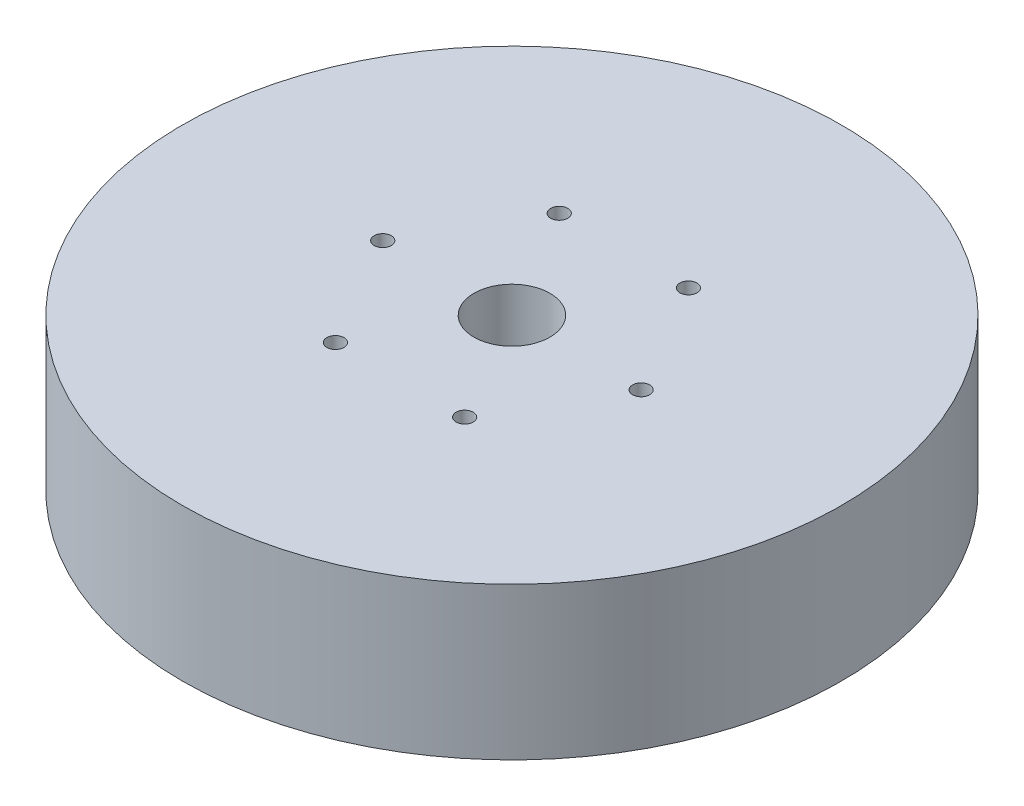
ISO-10303-21;
HEADER;
FILE_DESCRIPTION(('STEP AP214'),'2;1');
FILE_NAME('part.step','',(''),(''),'','','');
FILE_SCHEMA(('AUTOMOTIVE_DESIGN { 1 0 10303 214 1 1 1 1 }'));
ENDSEC;
DATA;
#1=APPLICATION_CONTEXT('core data for automotive mechanical design processes');
#2=APPLICATION_PROTOCOL_DEFINITION('international standard','automotive_design',2000,#1);
#3=PRODUCT_CONTEXT('',#1,'mechanical');
#4=PRODUCT('Part','Part','',(#3));
#5=PRODUCT_RELATED_PRODUCT_CATEGORY('part','',(#4));
#6=PRODUCT_DEFINITION_FORMATION('','',#4);
#7=PRODUCT_DEFINITION_CONTEXT('part definition',#1,'design');
#8=PRODUCT_DEFINITION('design','',#6,#7);
#9=PRODUCT_DEFINITION_SHAPE('','',#8);
#10=(LENGTH_UNIT() NAMED_UNIT(*) SI_UNIT(.MILLI.,.METRE.));
#11=(NAMED_UNIT(*) PLANE_ANGLE_UNIT() SI_UNIT($,.RADIAN.));
#12=(NAMED_UNIT(*) SI_UNIT($,.STERADIAN.) SOLID_ANGLE_UNIT());
#13=UNCERTAINTY_MEASURE_WITH_UNIT(LENGTH_MEASURE(1.E-05),#10,'distance_accuracy_value','');
#14=(GEOMETRIC_REPRESENTATION_CONTEXT(3) GLOBAL_UNCERTAINTY_ASSIGNED_CONTEXT((#13)) GLOBAL_UNIT_ASSIGNED_CONTEXT((#10,
#11,#12)) REPRESENTATION_CONTEXT('',''));
#15=CARTESIAN_POINT('',(0.,0.,0.));
#16=DIRECTION('',(0.,0.,1.));
#17=DIRECTION('',(1.,0.,0.));
#18=AXIS2_PLACEMENT_3D('',#15,#16,#17);
#19=CARTESIAN_POINT('',(0.,30.,0.));
#20=DIRECTION('',(0.,-1.,0.));
#21=DIRECTION('',(0.,0.,-1.));
#22=AXIS2_PLACEMENT_3D('',#19,#20,#21);
#23=CYLINDRICAL_SURFACE('',#22,65.);
#24=CARTESIAN_POINT('',(0.,30.,0.));
#25=DIRECTION('',(0.,1.,0.));
#26=DIRECTION('',(0.,0.,1.));
#27=AXIS2_PLACEMENT_3D('',#24,#25,#26);
#28=CIRCLE('',#27,65.);
#29=CARTESIAN_POINT('',(0.,30.,65.));
#30=VERTEX_POINT('',#29);
#31=EDGE_CURVE('E10',#30,#30,#28,.T.);
#32=ORIENTED_EDGE('',*,*,#31,.F.);
#33=EDGE_LOOP('',(#32));
#34=FACE_BOUND('',#33,.T.);
#35=CARTESIAN_POINT('',(0.,0.,0.));
#36=DIRECTION('',(0.,1.,0.));
#37=DIRECTION('',(0.,0.,1.));
#38=AXIS2_PLACEMENT_3D('',#35,#36,#37);
#39=CIRCLE('',#38,65.);
#40=CARTESIAN_POINT('',(0.,0.,65.));
#41=VERTEX_POINT('',#40);
#42=EDGE_CURVE('E37',#41,#41,#39,.T.);
#43=ORIENTED_EDGE('',*,*,#42,.T.);
#44=EDGE_LOOP('',(#43));
#45=FACE_BOUND('',#44,.T.);
#46=ADVANCED_FACE('F40',(#34,#45),#23,.T.);
#47=CARTESIAN_POINT('',(0.,30.,0.));
#48=DIRECTION('',(0.,1.,0.));
#49=DIRECTION('',(0.,0.,1.));
#50=AXIS2_PLACEMENT_3D('',#47,#48,#49);
#51=PLANE('',#50);
#52=CARTESIAN_POINT('',(-12.7423563562198,30.,-22.0704086171202));
#53=DIRECTION('',(0.,1.,0.));
#54=DIRECTION('',(-0.866025403784433,0.,0.50000000000001));
#55=AXIS2_PLACEMENT_3D('',#52,#53,#54);
#56=CIRCLE('',#55,1.69006326289167);
#57=CARTESIAN_POINT('',(-14.2059940758867,30.,-21.2253769856744));
#58=VERTEX_POINT('',#57);
#59=EDGE_CURVE('E70',#58,#58,#56,.T.);
#60=ORIENTED_EDGE('',*,*,#59,.F.);
#61=EDGE_LOOP('',(#60));
#62=FACE_BOUND('',#61,.T.);
#63=CARTESIAN_POINT('',(12.7423563562193,30.,-22.0704086171205));
#64=DIRECTION('',(0.,1.,0.));
#65=DIRECTION('',(-0.866025403784443,0.,-0.499999999999992));
#66=AXIS2_PLACEMENT_3D('',#63,#64,#65);
#67=CIRCLE('',#66,1.69006326289167);
#68=CARTESIAN_POINT('',(11.2787186365523,30.,-22.9154402485663));
#69=VERTEX_POINT('',#68);
#70=EDGE_CURVE('E71',#69,#69,#67,.T.);
#71=ORIENTED_EDGE('',*,*,#70,.F.);
#72=EDGE_LOOP('',(#71));
#73=FACE_BOUND('',#72,.T.);
#74=CARTESIAN_POINT('',(25.484712712439,30.,0.));
#75=DIRECTION('',(0.,1.,0.));
#76=DIRECTION('',(0.,0.,-1.));
#77=AXIS2_PLACEMENT_3D('',#74,#75,#76);
#78=CIRCLE('',#77,1.69006326289167);
#79=CARTESIAN_POINT('',(25.484712712439,30.,-1.69006326289167));
#80=VERTEX_POINT('',#79);
#81=EDGE_CURVE('E78',#80,#80,#78,.T.);
#82=ORIENTED_EDGE('',*,*,#81,.F.);
#83=EDGE_LOOP('',(#82));
#84=FACE_BOUND('',#83,.T.);
#85=CARTESIAN_POINT('',(12.7423563562196,30.,22.0704086171203));
#86=DIRECTION('',(0.,1.,0.));
#87=DIRECTION('',(0.866025403784436,0.,-0.500000000000004));
#88=AXIS2_PLACEMENT_3D('',#85,#86,#87);
#89=CIRCLE('',#88,1.69006326289167);
#90=CARTESIAN_POINT('',(14.2059940758866,30.,21.2253769856745));
#91=VERTEX_POINT('',#90);
#92=EDGE_CURVE('E84',#91,#91,#89,.T.);
#93=ORIENTED_EDGE('',*,*,#92,.F.);
#94=EDGE_LOOP('',(#93));
#95=FACE_BOUND('',#94,.T.);
#96=CARTESIAN_POINT('',(-12.7423563562194,30.,22.0704086171204));
#97=DIRECTION('',(0.,1.,0.));
#98=DIRECTION('',(0.86602540378444,0.,0.499999999999998));
#99=AXIS2_PLACEMENT_3D('',#96,#97,#98);
#100=CIRCLE('',#99,1.69006326289167);
#101=CARTESIAN_POINT('',(-11.2787186365524,30.,22.9154402485663));
#102=VERTEX_POINT('',#101);
#103=EDGE_CURVE('E61',#102,#102,#100,.T.);
#104=ORIENTED_EDGE('',*,*,#103,.F.);
#105=EDGE_LOOP('',(#104));
#106=FACE_BOUND('',#105,.T.);
#107=CARTESIAN_POINT('',(-25.484712712439,30.,0.));
#108=DIRECTION('',(0.,1.,0.));
#109=DIRECTION('',(0.,0.,1.));
#110=AXIS2_PLACEMENT_3D('',#107,#108,#109);
#111=CIRCLE('',#110,1.69006326289167);
#112=CARTESIAN_POINT('',(-25.484712712439,30.,1.69006326289167));
#113=VERTEX_POINT('',#112);
#114=EDGE_CURVE('E54',#113,#113,#111,.T.);
#115=ORIENTED_EDGE('',*,*,#114,.F.);
#116=EDGE_LOOP('',(#115));
#117=FACE_BOUND('',#116,.T.);
#118=CARTESIAN_POINT('',(0.,30.,0.));
#119=DIRECTION('',(0.,1.,0.));
#120=DIRECTION('',(0.,0.,1.));
#121=AXIS2_PLACEMENT_3D('',#118,#119,#120);
#122=CIRCLE('',#121,7.5);
#123=CARTESIAN_POINT('',(0.,30.,7.5));
#124=VERTEX_POINT('',#123);
#125=EDGE_CURVE('E50',#124,#124,#122,.T.);
#126=ORIENTED_EDGE('',*,*,#125,.F.);
#127=EDGE_LOOP('',(#126));
#128=FACE_BOUND('',#127,.T.);
#129=ORIENTED_EDGE('',*,*,#31,.T.);
#130=EDGE_LOOP('',(#129));
#131=FACE_BOUND('',#130,.T.);
#132=ADVANCED_FACE('F99',(#62,#73,#84,#95,#106,#117,#128,#131),#51,.T.);
#133=CARTESIAN_POINT('',(0.,0.,0.));
#134=DIRECTION('',(0.,1.,0.));
#135=DIRECTION('',(0.,0.,1.));
#136=AXIS2_PLACEMENT_3D('',#133,#134,#135);
#137=PLANE('',#136);
#138=CARTESIAN_POINT('',(0.,0.,0.));
#139=DIRECTION('',(0.,1.,0.));
#140=DIRECTION('',(0.,0.,1.));
#141=AXIS2_PLACEMENT_3D('',#138,#139,#140);
#142=CIRCLE('',#141,7.5);
#143=CARTESIAN_POINT('',(0.,0.,7.5));
#144=VERTEX_POINT('',#143);
#145=EDGE_CURVE('E47',#144,#144,#142,.T.);
#146=ORIENTED_EDGE('',*,*,#145,.T.);
#147=EDGE_LOOP('',(#146));
#148=FACE_BOUND('',#147,.T.);
#149=ORIENTED_EDGE('',*,*,#42,.F.);
#150=EDGE_LOOP('',(#149));
#151=FACE_BOUND('',#150,.T.);
#152=ADVANCED_FACE('F103',(#148,#151),#137,.F.);
#153=CARTESIAN_POINT('',(0.,30.,0.));
#154=DIRECTION('',(0.,-1.,0.));
#155=DIRECTION('',(0.,0.,-1.));
#156=AXIS2_PLACEMENT_3D('',#153,#154,#155);
#157=CYLINDRICAL_SURFACE('',#156,7.5);
#158=ORIENTED_EDGE('',*,*,#125,.T.);
#159=EDGE_LOOP('',(#158));
#160=FACE_BOUND('',#159,.T.);
#161=ORIENTED_EDGE('',*,*,#145,.F.);
#162=EDGE_LOOP('',(#161));
#163=FACE_BOUND('',#162,.T.);
#164=ADVANCED_FACE('F115',(#160,#163),#157,.F.);
#165=CARTESIAN_POINT('',(-25.484712712439,9.67585567307731,0.));
#166=DIRECTION('',(0.,1.,0.));
#167=DIRECTION('',(0.,0.,1.));
#168=AXIS2_PLACEMENT_3D('',#165,#166,#167);
#169=CYLINDRICAL_SURFACE('',#168,1.69006326289167);
#170=CARTESIAN_POINT('',(-25.484712712439,9.67585567307731,0.));
#171=DIRECTION('',(0.,1.,0.));
#172=DIRECTION('',(0.,0.,1.));
#173=AXIS2_PLACEMENT_3D('',#170,#171,#172);
#174=CIRCLE('',#173,1.69006326289167);
#175=CARTESIAN_POINT('',(-25.484712712439,9.67585567307731,1.69006326289167));
#176=VERTEX_POINT('',#175);
#177=EDGE_CURVE('E55',#176,#176,#174,.T.);
#178=ORIENTED_EDGE('',*,*,#177,.F.);
#179=EDGE_LOOP('',(#178));
#180=FACE_BOUND('',#179,.T.);
#181=ORIENTED_EDGE('',*,*,#114,.T.);
#182=EDGE_LOOP('',(#181));
#183=FACE_BOUND('',#182,.T.);
#184=ADVANCED_FACE('F113',(#180,#183),#169,.F.);
#185=CARTESIAN_POINT('',(-25.484712712439,9.67585567307731,0.));
#186=DIRECTION('',(0.,1.,0.));
#187=DIRECTION('',(0.,0.,1.));
#188=AXIS2_PLACEMENT_3D('',#185,#186,#187);
#189=PLANE('',#188);
#190=ORIENTED_EDGE('',*,*,#177,.T.);
#191=EDGE_LOOP('',(#190));
#192=FACE_BOUND('',#191,.T.);
#193=ADVANCED_FACE('F144',(#192),#189,.T.);
#194=CARTESIAN_POINT('',(-12.7423563562194,9.67585567307731,22.0704086171204));
#195=DIRECTION('',(0.,1.,0.));
#196=DIRECTION('',(0.,0.,1.));
#197=AXIS2_PLACEMENT_3D('',#194,#195,#196);
#198=CYLINDRICAL_SURFACE('',#197,1.69006326289167);
#199=CARTESIAN_POINT('',(-12.7423563562194,9.67585567307731,22.0704086171204));
#200=DIRECTION('',(0.,1.,0.));
#201=DIRECTION('',(0.86602540378444,0.,0.499999999999998));
#202=AXIS2_PLACEMENT_3D('',#199,#200,#201);
#203=CIRCLE('',#202,1.69006326289167);
#204=CARTESIAN_POINT('',(-11.2787186365524,9.67585567307731,22.9154402485663));
#205=VERTEX_POINT('',#204);
#206=EDGE_CURVE('E59',#205,#205,#203,.T.);
#207=ORIENTED_EDGE('',*,*,#206,.F.);
#208=EDGE_LOOP('',(#207));
#209=FACE_BOUND('',#208,.T.);
#210=ORIENTED_EDGE('',*,*,#103,.T.);
#211=EDGE_LOOP('',(#210));
#212=FACE_BOUND('',#211,.T.);
#213=ADVANCED_FACE('F153',(#209,#212),#198,.F.);
#214=CARTESIAN_POINT('',(-12.7423563562194,9.67585567307731,22.0704086171204));
#215=DIRECTION('',(0.,1.,0.));
#216=DIRECTION('',(0.86602540378444,0.,0.499999999999998));
#217=AXIS2_PLACEMENT_3D('',#214,#215,#216);
#218=PLANE('',#217);
#219=ORIENTED_EDGE('',*,*,#206,.T.);
#220=EDGE_LOOP('',(#219));
#221=FACE_BOUND('',#220,.T.);
#222=ADVANCED_FACE('F96',(#221),#218,.T.);
#223=CARTESIAN_POINT('',(12.7423563562196,9.67585567307731,22.0704086171203));
#224=DIRECTION('',(0.,1.,0.));
#225=DIRECTION('',(0.,0.,1.));
#226=AXIS2_PLACEMENT_3D('',#223,#224,#225);
#227=CYLINDRICAL_SURFACE('',#226,1.69006326289167);
#228=CARTESIAN_POINT('',(12.7423563562196,9.67585567307731,22.0704086171203));
#229=DIRECTION('',(0.,1.,0.));
#230=DIRECTION('',(0.866025403784436,0.,-0.500000000000004));
#231=AXIS2_PLACEMENT_3D('',#228,#229,#230);
#232=CIRCLE('',#231,1.69006326289167);
#233=CARTESIAN_POINT('',(14.2059940758866,9.67585567307731,21.2253769856745));
#234=VERTEX_POINT('',#233);
#235=EDGE_CURVE('E63',#234,#234,#232,.T.);
#236=ORIENTED_EDGE('',*,*,#235,.F.);
#237=EDGE_LOOP('',(#236));
#238=FACE_BOUND('',#237,.T.);
#239=ORIENTED_EDGE('',*,*,#92,.T.);
#240=EDGE_LOOP('',(#239));
#241=FACE_BOUND('',#240,.T.);
#242=ADVANCED_FACE('F91',(#238,#241),#227,.F.);
#243=CARTESIAN_POINT('',(12.7423563562196,9.67585567307731,22.0704086171203));
#244=DIRECTION('',(0.,1.,0.));
#245=DIRECTION('',(0.866025403784436,0.,-0.500000000000004));
#246=AXIS2_PLACEMENT_3D('',#243,#244,#245);
#247=PLANE('',#246);
#248=ORIENTED_EDGE('',*,*,#235,.T.);
#249=EDGE_LOOP('',(#248));
#250=FACE_BOUND('',#249,.T.);
#251=ADVANCED_FACE('F93',(#250),#247,.T.);
#252=CARTESIAN_POINT('',(25.484712712439,9.67585567307731,0.));
#253=DIRECTION('',(0.,1.,0.));
#254=DIRECTION('',(0.,0.,1.));
#255=AXIS2_PLACEMENT_3D('',#252,#253,#254);
#256=CYLINDRICAL_SURFACE('',#255,1.69006326289167);
#257=CARTESIAN_POINT('',(25.484712712439,9.67585567307731,0.));
#258=DIRECTION('',(0.,1.,0.));
#259=DIRECTION('',(0.,0.,-1.));
#260=AXIS2_PLACEMENT_3D('',#257,#258,#259);
#261=CIRCLE('',#260,1.69006326289167);
#262=CARTESIAN_POINT('',(25.484712712439,9.67585567307731,-1.69006326289167));
#263=VERTEX_POINT('',#262);
#264=EDGE_CURVE('E85',#263,#263,#261,.T.);
#265=ORIENTED_EDGE('',*,*,#264,.F.);
#266=EDGE_LOOP('',(#265));
#267=FACE_BOUND('',#266,.T.);
#268=ORIENTED_EDGE('',*,*,#81,.T.);
#269=EDGE_LOOP('',(#268));
#270=FACE_BOUND('',#269,.T.);
#271=ADVANCED_FACE('F187',(#267,#270),#256,.F.);
#272=CARTESIAN_POINT('',(25.484712712439,9.67585567307731,0.));
#273=DIRECTION('',(0.,1.,0.));
#274=DIRECTION('',(0.,0.,-1.));
#275=AXIS2_PLACEMENT_3D('',#272,#273,#274);
#276=PLANE('',#275);
#277=ORIENTED_EDGE('',*,*,#264,.T.);
#278=EDGE_LOOP('',(#277));
#279=FACE_BOUND('',#278,.T.);
#280=ADVANCED_FACE('F198',(#279),#276,.T.);
#281=CARTESIAN_POINT('',(12.7423563562193,9.67585567307731,-22.0704086171205));
#282=DIRECTION('',(0.,1.,0.));
#283=DIRECTION('',(0.,0.,1.));
#284=AXIS2_PLACEMENT_3D('',#281,#282,#283);
#285=CYLINDRICAL_SURFACE('',#284,1.69006326289167);
#286=CARTESIAN_POINT('',(12.7423563562193,9.67585567307731,-22.0704086171205));
#287=DIRECTION('',(0.,1.,0.));
#288=DIRECTION('',(-0.866025403784443,0.,-0.499999999999992));
#289=AXIS2_PLACEMENT_3D('',#286,#287,#288);
#290=CIRCLE('',#289,1.69006326289167);
#291=CARTESIAN_POINT('',(11.2787186365523,9.67585567307731,-22.9154402485663));
#292=VERTEX_POINT('',#291);
#293=EDGE_CURVE('E76',#292,#292,#290,.T.);
#294=ORIENTED_EDGE('',*,*,#293,.F.);
#295=EDGE_LOOP('',(#294));
#296=FACE_BOUND('',#295,.T.);
#297=ORIENTED_EDGE('',*,*,#70,.T.);
#298=EDGE_LOOP('',(#297));
#299=FACE_BOUND('',#298,.T.);
#300=ADVANCED_FACE('F202',(#296,#299),#285,.F.);
#301=CARTESIAN_POINT('',(12.7423563562193,9.67585567307731,-22.0704086171205));
#302=DIRECTION('',(0.,1.,0.));
#303=DIRECTION('',(-0.866025403784443,0.,-0.499999999999992));
#304=AXIS2_PLACEMENT_3D('',#301,#302,#303);
#305=PLANE('',#304);
#306=ORIENTED_EDGE('',*,*,#293,.T.);
#307=EDGE_LOOP('',(#306));
#308=FACE_BOUND('',#307,.T.);
#309=ADVANCED_FACE('F212',(#308),#305,.T.);
#310=CARTESIAN_POINT('',(-12.7423563562198,9.67585567307731,-22.0704086171202));
#311=DIRECTION('',(0.,1.,0.));
#312=DIRECTION('',(0.,0.,1.));
#313=AXIS2_PLACEMENT_3D('',#310,#311,#312);
#314=CYLINDRICAL_SURFACE('',#313,1.69006326289167);
#315=CARTESIAN_POINT('',(-12.7423563562198,9.67585567307731,-22.0704086171202));
#316=DIRECTION('',(0.,1.,0.));
#317=DIRECTION('',(-0.866025403784433,0.,0.50000000000001));
#318=AXIS2_PLACEMENT_3D('',#315,#316,#317);
#319=CIRCLE('',#318,1.69006326289167);
#320=CARTESIAN_POINT('',(-14.2059940758867,9.67585567307731,-21.2253769856744));
#321=VERTEX_POINT('',#320);
#322=EDGE_CURVE('E69',#321,#321,#319,.T.);
#323=ORIENTED_EDGE('',*,*,#322,.F.);
#324=EDGE_LOOP('',(#323));
#325=FACE_BOUND('',#324,.T.);
#326=ORIENTED_EDGE('',*,*,#59,.T.);
#327=EDGE_LOOP('',(#326));
#328=FACE_BOUND('',#327,.T.);
#329=ADVANCED_FACE('F224',(#325,#328),#314,.F.);
#330=CARTESIAN_POINT('',(-12.7423563562198,9.67585567307731,-22.0704086171202));
#331=DIRECTION('',(0.,1.,0.));
#332=DIRECTION('',(-0.866025403784433,0.,0.50000000000001));
#333=AXIS2_PLACEMENT_3D('',#330,#331,#332);
#334=PLANE('',#333);
#335=ORIENTED_EDGE('',*,*,#322,.T.);
#336=EDGE_LOOP('',(#335));
#337=FACE_BOUND('',#336,.T.);
#338=ADVANCED_FACE('F235',(#337),#334,.T.);
#339=CLOSED_SHELL('',(#46,#132,#152,#164,#184,#193,#213,#222,#242,#251,#271,#280,#300,#309,#329,#338));
#340=MANIFOLD_SOLID_BREP('B2',#339);
#341=ADVANCED_BREP_SHAPE_REPRESENTATION('',(#18,#340),#14);
#342=SHAPE_DEFINITION_REPRESENTATION(#9,#341);
ENDSEC;
END-ISO-10303-21;
